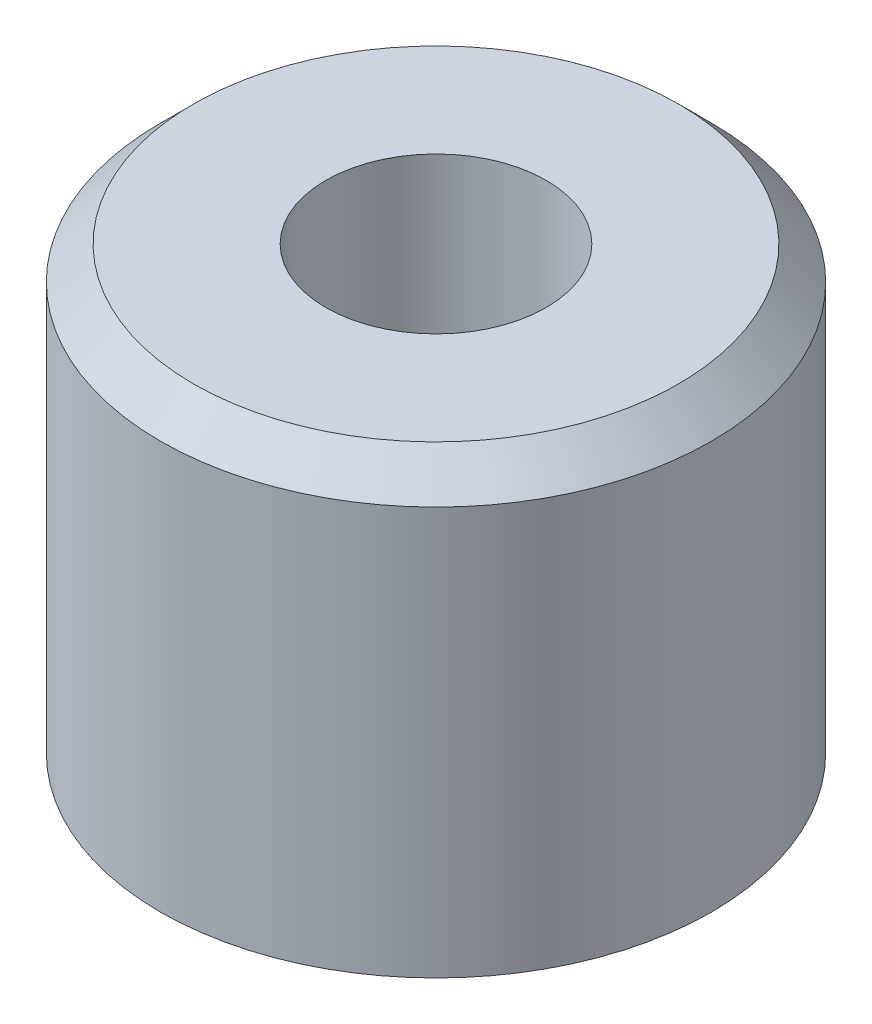
ISO-10303-21;
HEADER;
FILE_DESCRIPTION(('STEP AP214'),'2;1');
FILE_NAME('part.step','',(''),(''),'','','');
FILE_SCHEMA(('AUTOMOTIVE_DESIGN { 1 0 10303 214 1 1 1 1 }'));
ENDSEC;
DATA;
#1=APPLICATION_CONTEXT('core data for automotive mechanical design processes');
#2=APPLICATION_PROTOCOL_DEFINITION('international standard','automotive_design',2000,#1);
#3=PRODUCT_CONTEXT('',#1,'mechanical');
#4=PRODUCT('Part','Part','',(#3));
#5=PRODUCT_RELATED_PRODUCT_CATEGORY('part','',(#4));
#6=PRODUCT_DEFINITION_FORMATION('','',#4);
#7=PRODUCT_DEFINITION_CONTEXT('part definition',#1,'design');
#8=PRODUCT_DEFINITION('design','',#6,#7);
#9=PRODUCT_DEFINITION_SHAPE('','',#8);
#10=(LENGTH_UNIT() NAMED_UNIT(*) SI_UNIT(.MILLI.,.METRE.));
#11=(NAMED_UNIT(*) PLANE_ANGLE_UNIT() SI_UNIT($,.RADIAN.));
#12=(NAMED_UNIT(*) SI_UNIT($,.STERADIAN.) SOLID_ANGLE_UNIT());
#13=UNCERTAINTY_MEASURE_WITH_UNIT(LENGTH_MEASURE(1.E-05),#10,'distance_accuracy_value','');
#14=(GEOMETRIC_REPRESENTATION_CONTEXT(3) GLOBAL_UNCERTAINTY_ASSIGNED_CONTEXT((#13)) GLOBAL_UNIT_ASSIGNED_CONTEXT((#10,
#11,#12)) REPRESENTATION_CONTEXT('',''));
#15=CARTESIAN_POINT('',(0.,0.,0.));
#16=DIRECTION('',(0.,0.,1.));
#17=DIRECTION('',(1.,0.,0.));
#18=AXIS2_PLACEMENT_3D('',#15,#16,#17);
#19=CARTESIAN_POINT('',(0.,101.6,0.));
#20=DIRECTION('',(0.,-1.,0.));
#21=DIRECTION('',(0.,0.,-1.));
#22=AXIS2_PLACEMENT_3D('',#19,#20,#21);
#23=CYLINDRICAL_SURFACE('',#22,63.5);
#24=CARTESIAN_POINT('',(0.,93.98,0.));
#25=DIRECTION('',(0.,1.,0.));
#26=DIRECTION('',(0.,0.,1.));
#27=AXIS2_PLACEMENT_3D('',#24,#25,#26);
#28=CIRCLE('',#27,63.5);
#29=CARTESIAN_POINT('',(0.,93.98,63.5));
#30=VERTEX_POINT('',#29);
#31=EDGE_CURVE('E12',#30,#30,#28,.F.);
#32=ORIENTED_EDGE('',*,*,#31,.T.);
#33=EDGE_LOOP('',(#32));
#34=FACE_BOUND('',#33,.T.);
#35=CARTESIAN_POINT('',(0.,0.,0.));
#36=DIRECTION('',(0.,1.,0.));
#37=DIRECTION('',(0.,0.,1.));
#38=AXIS2_PLACEMENT_3D('',#35,#36,#37);
#39=CIRCLE('',#38,63.5);
#40=CARTESIAN_POINT('',(0.,0.,63.5));
#41=VERTEX_POINT('',#40);
#42=EDGE_CURVE('E57',#41,#41,#39,.T.);
#43=ORIENTED_EDGE('',*,*,#42,.T.);
#44=EDGE_LOOP('',(#43));
#45=FACE_BOUND('',#44,.T.);
#46=ADVANCED_FACE('F43',(#34,#45),#23,.T.);
#47=CARTESIAN_POINT('',(0.,101.6,0.));
#48=DIRECTION('',(0.,1.,0.));
#49=DIRECTION('',(0.,0.,1.));
#50=AXIS2_PLACEMENT_3D('',#47,#48,#49);
#51=PLANE('',#50);
#52=CARTESIAN_POINT('',(0.,101.6,0.));
#53=DIRECTION('',(0.,1.,0.));
#54=DIRECTION('',(0.,0.,1.));
#55=AXIS2_PLACEMENT_3D('',#52,#53,#54);
#56=CIRCLE('',#55,55.88);
#57=CARTESIAN_POINT('',(0.,101.6,55.88));
#58=VERTEX_POINT('',#57);
#59=EDGE_CURVE('E52',#58,#58,#56,.T.);
#60=ORIENTED_EDGE('',*,*,#59,.T.);
#61=EDGE_LOOP('',(#60));
#62=FACE_BOUND('',#61,.T.);
#63=CARTESIAN_POINT('',(0.,101.6,0.));
#64=DIRECTION('',(0.,1.,0.));
#65=DIRECTION('',(0.,0.,1.));
#66=AXIS2_PLACEMENT_3D('',#63,#64,#65);
#67=CIRCLE('',#66,25.4);
#68=CARTESIAN_POINT('',(0.,101.6,25.4));
#69=VERTEX_POINT('',#68);
#70=EDGE_CURVE('E65',#69,#69,#67,.T.);
#71=ORIENTED_EDGE('',*,*,#70,.F.);
#72=EDGE_LOOP('',(#71));
#73=FACE_BOUND('',#72,.T.);
#74=ADVANCED_FACE('F82',(#62,#73),#51,.T.);
#75=CARTESIAN_POINT('',(0.,0.,0.));
#76=DIRECTION('',(0.,1.,0.));
#77=DIRECTION('',(0.,0.,1.));
#78=AXIS2_PLACEMENT_3D('',#75,#76,#77);
#79=PLANE('',#78);
#80=ORIENTED_EDGE('',*,*,#42,.F.);
#81=EDGE_LOOP('',(#80));
#82=FACE_BOUND('',#81,.T.);
#83=ADVANCED_FACE('F78',(#82),#79,.F.);
#84=CARTESIAN_POINT('',(0.,12.7,0.));
#85=DIRECTION('',(0.,1.,0.));
#86=DIRECTION('',(0.,0.,1.));
#87=AXIS2_PLACEMENT_3D('',#84,#85,#86);
#88=CYLINDRICAL_SURFACE('',#87,25.4);
#89=CARTESIAN_POINT('',(0.,12.7,0.));
#90=DIRECTION('',(0.,1.,0.));
#91=DIRECTION('',(0.,0.,1.));
#92=AXIS2_PLACEMENT_3D('',#89,#90,#91);
#93=CIRCLE('',#92,25.4);
#94=CARTESIAN_POINT('',(0.,12.7,25.4));
#95=VERTEX_POINT('',#94);
#96=EDGE_CURVE('E62',#95,#95,#93,.T.);
#97=ORIENTED_EDGE('',*,*,#96,.F.);
#98=EDGE_LOOP('',(#97));
#99=FACE_BOUND('',#98,.T.);
#100=ORIENTED_EDGE('',*,*,#70,.T.);
#101=EDGE_LOOP('',(#100));
#102=FACE_BOUND('',#101,.T.);
#103=ADVANCED_FACE('F75',(#99,#102),#88,.F.);
#104=CARTESIAN_POINT('',(0.,12.7,0.));
#105=DIRECTION('',(0.,1.,0.));
#106=DIRECTION('',(0.,0.,1.));
#107=AXIS2_PLACEMENT_3D('',#104,#105,#106);
#108=PLANE('',#107);
#109=ORIENTED_EDGE('',*,*,#96,.T.);
#110=EDGE_LOOP('',(#109));
#111=FACE_BOUND('',#110,.T.);
#112=ADVANCED_FACE('F73',(#111),#108,.T.);
#113=CARTESIAN_POINT('',(0.,101.6,0.));
#114=DIRECTION('',(0.,-1.,0.));
#115=DIRECTION('',(0.,0.,-1.));
#116=AXIS2_PLACEMENT_3D('',#113,#114,#115);
#117=CONICAL_SURFACE('',#116,55.88,0.785398163397448);
#118=ORIENTED_EDGE('',*,*,#31,.F.);
#119=EDGE_LOOP('',(#118));
#120=FACE_BOUND('',#119,.T.);
#121=ORIENTED_EDGE('',*,*,#59,.F.);
#122=EDGE_LOOP('',(#121));
#123=FACE_BOUND('',#122,.T.);
#124=ADVANCED_FACE('F46',(#120,#123),#117,.T.);
#125=CLOSED_SHELL('',(#46,#74,#83,#103,#112,#124));
#126=MANIFOLD_SOLID_BREP('B2',#125);
#127=ADVANCED_BREP_SHAPE_REPRESENTATION('',(#18,#126),#14);
#128=SHAPE_DEFINITION_REPRESENTATION(#9,#127);
ENDSEC;
END-ISO-10303-21;
